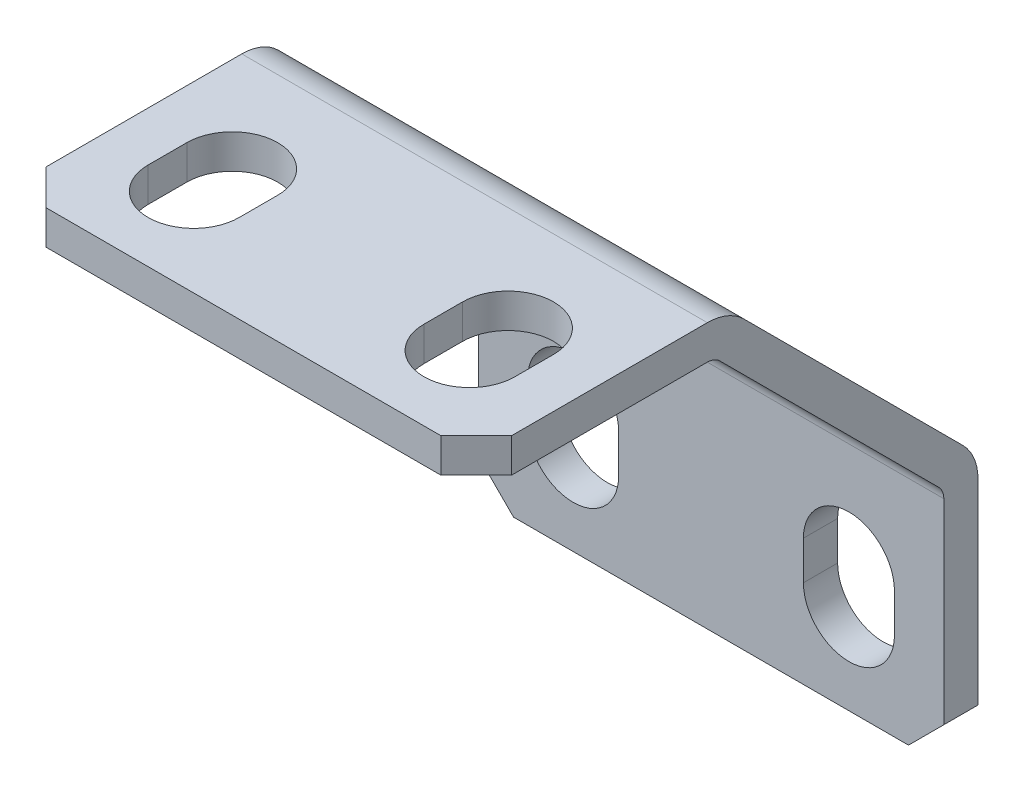
ISO-10303-21;
HEADER;
FILE_DESCRIPTION(('STEP AP214'),'2;1');
FILE_NAME('part.step','',(''),(''),'','','');
FILE_SCHEMA(('AUTOMOTIVE_DESIGN { 1 0 10303 214 1 1 1 1 }'));
ENDSEC;
DATA;
#1=APPLICATION_CONTEXT('core data for automotive mechanical design processes');
#2=APPLICATION_PROTOCOL_DEFINITION('international standard','automotive_design',2000,#1);
#3=PRODUCT_CONTEXT('',#1,'mechanical');
#4=PRODUCT('Part','Part','',(#3));
#5=PRODUCT_RELATED_PRODUCT_CATEGORY('part','',(#4));
#6=PRODUCT_DEFINITION_FORMATION('','',#4);
#7=PRODUCT_DEFINITION_CONTEXT('part definition',#1,'design');
#8=PRODUCT_DEFINITION('design','',#6,#7);
#9=PRODUCT_DEFINITION_SHAPE('','',#8);
#10=(LENGTH_UNIT() NAMED_UNIT(*) SI_UNIT(.MILLI.,.METRE.));
#11=(NAMED_UNIT(*) PLANE_ANGLE_UNIT() SI_UNIT($,.RADIAN.));
#12=(NAMED_UNIT(*) SI_UNIT($,.STERADIAN.) SOLID_ANGLE_UNIT());
#13=UNCERTAINTY_MEASURE_WITH_UNIT(LENGTH_MEASURE(1.E-05),#10,'distance_accuracy_value','');
#14=(GEOMETRIC_REPRESENTATION_CONTEXT(3) GLOBAL_UNCERTAINTY_ASSIGNED_CONTEXT((#13)) GLOBAL_UNIT_ASSIGNED_CONTEXT((#10,
#11,#12)) REPRESENTATION_CONTEXT('',''));
#15=CARTESIAN_POINT('',(0.,0.,0.));
#16=DIRECTION('',(0.,0.,1.));
#17=DIRECTION('',(1.,0.,0.));
#18=AXIS2_PLACEMENT_3D('',#15,#16,#17);
#19=CARTESIAN_POINT('',(-10.7188,17.785895496044,11.4756191945219));
#20=DIRECTION('',(0.,1.,0.));
#21=DIRECTION('',(0.,0.,1.));
#22=AXIS2_PLACEMENT_3D('',#19,#20,#21);
#23=PLANE('',#22);
#24=CARTESIAN_POINT('',(6.34999999999999,17.7858954960441,19.0499999999998));
#25=DIRECTION('',(0.,1.,0.));
#26=DIRECTION('',(0.,0.,1.));
#27=AXIS2_PLACEMENT_3D('',#24,#25,#26);
#28=CIRCLE('',#27,2.0955);
#29=CARTESIAN_POINT('',(4.2545,17.7858954960441,19.0499999999998));
#30=VERTEX_POINT('',#29);
#31=CARTESIAN_POINT('',(8.4455,17.7858954960441,19.0500000000001));
#32=VERTEX_POINT('',#31);
#33=EDGE_CURVE('E302',#30,#32,#28,.T.);
#34=ORIENTED_EDGE('',*,*,#33,.F.);
#35=DIRECTION('',(0.,0.,1.));
#36=VECTOR('',#35,1.);
#37=CARTESIAN_POINT('',(4.2545,17.7858954960441,17.2719999999998));
#38=LINE('',#37,#36);
#39=CARTESIAN_POINT('',(4.2545,17.7858954960441,17.2719999999998));
#40=VERTEX_POINT('',#39);
#41=EDGE_CURVE('E316',#40,#30,#38,.T.);
#42=ORIENTED_EDGE('',*,*,#41,.F.);
#43=CARTESIAN_POINT('',(6.35,17.7858954960441,17.2719999999998));
#44=DIRECTION('',(0.,1.,0.));
#45=DIRECTION('',(0.,0.,1.));
#46=AXIS2_PLACEMENT_3D('',#43,#44,#45);
#47=CIRCLE('',#46,2.0955);
#48=CARTESIAN_POINT('',(8.4455,17.7858954960441,17.2719999999998));
#49=VERTEX_POINT('',#48);
#50=EDGE_CURVE('E313',#49,#40,#47,.T.);
#51=ORIENTED_EDGE('',*,*,#50,.F.);
#52=DIRECTION('',(0.,0.,-1.));
#53=VECTOR('',#52,1.);
#54=CARTESIAN_POINT('',(8.4455,17.7858954960441,19.0499999999998));
#55=LINE('',#54,#53);
#56=EDGE_CURVE('E310',#32,#49,#55,.T.);
#57=ORIENTED_EDGE('',*,*,#56,.F.);
#58=EDGE_LOOP('',(#34,#42,#51,#57));
#59=FACE_BOUND('',#58,.T.);
#60=CARTESIAN_POINT('',(-6.35,17.7858954960442,17.2719999999998));
#61=DIRECTION('',(0.,-1.,0.));
#62=DIRECTION('',(0.,0.,-1.));
#63=AXIS2_PLACEMENT_3D('',#60,#61,#62);
#64=CIRCLE('',#63,2.0955);
#65=CARTESIAN_POINT('',(-8.4455,17.7858954960442,17.2719999999998));
#66=VERTEX_POINT('',#65);
#67=CARTESIAN_POINT('',(-4.2545,17.7858954960442,17.2719999999998));
#68=VERTEX_POINT('',#67);
#69=EDGE_CURVE('E329',#66,#68,#64,.T.);
#70=ORIENTED_EDGE('',*,*,#69,.T.);
#71=DIRECTION('',(0.,0.,1.));
#72=VECTOR('',#71,1.);
#73=CARTESIAN_POINT('',(-4.2545,17.7858954960442,17.2719999999998));
#74=LINE('',#73,#72);
#75=CARTESIAN_POINT('',(-4.2545,17.7858954960441,19.0499999999998));
#76=VERTEX_POINT('',#75);
#77=EDGE_CURVE('E332',#68,#76,#74,.T.);
#78=ORIENTED_EDGE('',*,*,#77,.T.);
#79=CARTESIAN_POINT('',(-6.35,17.7858954960442,19.0499999999998));
#80=DIRECTION('',(0.,-1.,0.));
#81=DIRECTION('',(0.,0.,-1.));
#82=AXIS2_PLACEMENT_3D('',#79,#80,#81);
#83=CIRCLE('',#82,2.0955);
#84=CARTESIAN_POINT('',(-8.4455,17.7858954960442,19.0499999999998));
#85=VERTEX_POINT('',#84);
#86=EDGE_CURVE('E336',#76,#85,#83,.T.);
#87=ORIENTED_EDGE('',*,*,#86,.T.);
#88=DIRECTION('',(0.,0.,-1.));
#89=VECTOR('',#88,1.);
#90=CARTESIAN_POINT('',(-8.4455,17.7858954960442,19.0499999999998));
#91=LINE('',#90,#89);
#92=EDGE_CURVE('E339',#85,#66,#91,.T.);
#93=ORIENTED_EDGE('',*,*,#92,.T.);
#94=EDGE_LOOP('',(#70,#78,#87,#93));
#95=FACE_BOUND('',#94,.T.);
#96=DIRECTION('',(0.,0.,1.));
#97=VECTOR('',#96,1.);
#98=CARTESIAN_POINT('',(10.7188,17.785895496044,11.4756191945219));
#99=LINE('',#98,#97);
#100=CARTESIAN_POINT('',(10.7188,17.785895496044,12.4645954960439));
#101=VERTEX_POINT('',#100);
#102=CARTESIAN_POINT('',(10.7188,17.7858954960441,21.4806791945219));
#103=VERTEX_POINT('',#102);
#104=EDGE_CURVE('E380',#101,#103,#99,.T.);
#105=ORIENTED_EDGE('',*,*,#104,.F.);
#106=DIRECTION('',(1.,0.,0.));
#107=VECTOR('',#106,1.);
#108=CARTESIAN_POINT('',(-10.7188,17.785895496044,12.4645954960439));
#109=LINE('',#108,#107);
#110=CARTESIAN_POINT('',(-10.7188,17.785895496044,12.4645954960439));
#111=VERTEX_POINT('',#110);
#112=EDGE_CURVE('E11',#101,#111,#109,.F.);
#113=ORIENTED_EDGE('',*,*,#112,.T.);
#114=DIRECTION('',(0.,0.,1.));
#115=VECTOR('',#114,1.);
#116=CARTESIAN_POINT('',(-10.7188,17.785895496044,11.4756191945219));
#117=LINE('',#116,#115);
#118=CARTESIAN_POINT('',(-10.7188,17.7858954960441,21.4806791945219));
#119=VERTEX_POINT('',#118);
#120=EDGE_CURVE('E383',#111,#119,#117,.T.);
#121=ORIENTED_EDGE('',*,*,#120,.T.);
#122=DIRECTION('',(0.707106781186545,0.,0.70710678118655));
#123=VECTOR('',#122,1.);
#124=CARTESIAN_POINT('',(-15.72133,17.7858954960441,16.4781491945219));
#125=LINE('',#124,#123);
#126=CARTESIAN_POINT('',(-9.09320000000001,17.7858954960442,23.1062791945219));
#127=VERTEX_POINT('',#126);
#128=EDGE_CURVE('E439',#119,#127,#125,.T.);
#129=ORIENTED_EDGE('',*,*,#128,.T.);
#130=DIRECTION('',(1.,0.,0.));
#131=VECTOR('',#130,1.);
#132=CARTESIAN_POINT('',(-10.7188,17.7858954960442,23.1062791945219));
#133=LINE('',#132,#131);
#134=CARTESIAN_POINT('',(9.09319999999999,17.7858954960442,23.1062791945219));
#135=VERTEX_POINT('',#134);
#136=EDGE_CURVE('E391',#127,#135,#133,.T.);
#137=ORIENTED_EDGE('',*,*,#136,.T.);
#138=DIRECTION('',(-0.707106781186552,0.,0.707106781186543));
#139=VECTOR('',#138,1.);
#140=CARTESIAN_POINT('',(5.00252999999986,17.7858954960442,27.196949194522));
#141=LINE('',#140,#139);
#142=EDGE_CURVE('E441',#135,#103,#141,.F.);
#143=ORIENTED_EDGE('',*,*,#142,.T.);
#144=EDGE_LOOP('',(#105,#113,#121,#129,#137,#143));
#145=FACE_BOUND('',#144,.T.);
#146=ADVANCED_FACE('F32',(#59,#95,#145),#23,.T.);
#147=CARTESIAN_POINT('',(-10.7188,6.31027630152199,0.));
#148=DIRECTION('',(0.,0.707106781186544,-0.707106781186551));
#149=DIRECTION('',(0.,0.707106781186551,0.707106781186544));
#150=AXIS2_PLACEMENT_3D('',#147,#148,#149);
#151=PLANE('',#150);
#152=DIRECTION('',(0.,0.707106781186551,0.707106781186544));
#153=VECTOR('',#152,1.);
#154=CARTESIAN_POINT('',(10.7188,6.31027630152199,0.));
#155=LINE('',#154,#153);
#156=CARTESIAN_POINT('',(10.7188,7.00958815076099,0.699311849238991));
#157=VERTEX_POINT('',#156);
#158=CARTESIAN_POINT('',(10.7188,17.086583646805,10.7763073452829));
#159=VERTEX_POINT('',#158);
#160=EDGE_CURVE('E386',#157,#159,#155,.T.);
#161=ORIENTED_EDGE('',*,*,#160,.F.);
#162=DIRECTION('',(1.,0.,0.));
#163=VECTOR('',#162,1.);
#164=CARTESIAN_POINT('',(-10.7188,7.00958815076099,0.699311849238991));
#165=LINE('',#164,#163);
#166=CARTESIAN_POINT('',(-10.7188,7.00958815076099,0.699311849238991));
#167=VERTEX_POINT('',#166);
#168=EDGE_CURVE('E492',#157,#167,#165,.F.);
#169=ORIENTED_EDGE('',*,*,#168,.T.);
#170=DIRECTION('',(0.,0.707106781186551,0.707106781186544));
#171=VECTOR('',#170,1.);
#172=CARTESIAN_POINT('',(-10.7188,6.31027630152199,0.));
#173=LINE('',#172,#171);
#174=CARTESIAN_POINT('',(-10.7188,17.086583646805,10.7763073452829));
#175=VERTEX_POINT('',#174);
#176=EDGE_CURVE('E389',#167,#175,#173,.T.);
#177=ORIENTED_EDGE('',*,*,#176,.T.);
#178=DIRECTION('',(1.,0.,0.));
#179=VECTOR('',#178,1.);
#180=CARTESIAN_POINT('',(-10.7188,17.086583646805,10.7763073452829));
#181=LINE('',#180,#179);
#182=EDGE_CURVE('E489',#175,#159,#181,.T.);
#183=ORIENTED_EDGE('',*,*,#182,.T.);
#184=EDGE_LOOP('',(#161,#169,#177,#183));
#185=FACE_BOUND('',#184,.T.);
#186=ADVANCED_FACE('F509',(#185),#151,.T.);
#187=CARTESIAN_POINT('',(-10.7188,-5.3213,0.));
#188=DIRECTION('',(0.,0.,-1.));
#189=DIRECTION('',(-1.,0.,0.));
#190=AXIS2_PLACEMENT_3D('',#187,#188,#189);
#191=PLANE('',#190);
#192=CARTESIAN_POINT('',(-6.35,-1.26410450395596,0.));
#193=DIRECTION('',(0.,0.,-1.));
#194=DIRECTION('',(-1.,0.,0.));
#195=AXIS2_PLACEMENT_3D('',#192,#193,#194);
#196=CIRCLE('',#195,2.0955);
#197=CARTESIAN_POINT('',(-4.2545,-1.26410450395596,0.));
#198=VERTEX_POINT('',#197);
#199=CARTESIAN_POINT('',(-8.4455,-1.26410450395596,0.));
#200=VERTEX_POINT('',#199);
#201=EDGE_CURVE('E262',#198,#200,#196,.T.);
#202=ORIENTED_EDGE('',*,*,#201,.F.);
#203=DIRECTION('',(0.,-1.,0.));
#204=VECTOR('',#203,1.);
#205=CARTESIAN_POINT('',(-4.2545,0.513895496044045,0.));
#206=LINE('',#205,#204);
#207=CARTESIAN_POINT('',(-4.2545,0.513895496044045,0.));
#208=VERTEX_POINT('',#207);
#209=EDGE_CURVE('E267',#208,#198,#206,.T.);
#210=ORIENTED_EDGE('',*,*,#209,.F.);
#211=CARTESIAN_POINT('',(-6.35,0.513895496044045,0.));
#212=DIRECTION('',(0.,0.,-1.));
#213=DIRECTION('',(-1.,0.,0.));
#214=AXIS2_PLACEMENT_3D('',#211,#212,#213);
#215=CIRCLE('',#214,2.0955);
#216=CARTESIAN_POINT('',(-8.4455,0.513895496044045,0.));
#217=VERTEX_POINT('',#216);
#218=EDGE_CURVE('E246',#217,#208,#215,.T.);
#219=ORIENTED_EDGE('',*,*,#218,.F.);
#220=DIRECTION('',(0.,1.,0.));
#221=VECTOR('',#220,1.);
#222=CARTESIAN_POINT('',(-8.4455,-1.26410450395596,0.));
#223=LINE('',#222,#221);
#224=EDGE_CURVE('E257',#200,#217,#223,.T.);
#225=ORIENTED_EDGE('',*,*,#224,.F.);
#226=EDGE_LOOP('',(#202,#210,#219,#225));
#227=FACE_BOUND('',#226,.T.);
#228=CARTESIAN_POINT('',(6.35,0.513895496044045,0.));
#229=DIRECTION('',(0.,0.,1.));
#230=DIRECTION('',(1.,0.,0.));
#231=AXIS2_PLACEMENT_3D('',#228,#229,#230);
#232=CIRCLE('',#231,2.0955);
#233=CARTESIAN_POINT('',(8.4455,0.513895496044045,0.));
#234=VERTEX_POINT('',#233);
#235=CARTESIAN_POINT('',(4.2545,0.513895496044045,0.));
#236=VERTEX_POINT('',#235);
#237=EDGE_CURVE('E277',#234,#236,#232,.T.);
#238=ORIENTED_EDGE('',*,*,#237,.T.);
#239=DIRECTION('',(0.,-1.,0.));
#240=VECTOR('',#239,1.);
#241=CARTESIAN_POINT('',(4.2545,0.513895496044045,0.));
#242=LINE('',#241,#240);
#243=CARTESIAN_POINT('',(4.2545,-1.26410450395596,0.));
#244=VERTEX_POINT('',#243);
#245=EDGE_CURVE('E280',#236,#244,#242,.T.);
#246=ORIENTED_EDGE('',*,*,#245,.T.);
#247=CARTESIAN_POINT('',(6.35,-1.26410450395596,0.));
#248=DIRECTION('',(0.,0.,1.));
#249=DIRECTION('',(1.,0.,0.));
#250=AXIS2_PLACEMENT_3D('',#247,#248,#249);
#251=CIRCLE('',#250,2.0955);
#252=CARTESIAN_POINT('',(8.4455,-1.26410450395596,0.));
#253=VERTEX_POINT('',#252);
#254=EDGE_CURVE('E284',#244,#253,#251,.T.);
#255=ORIENTED_EDGE('',*,*,#254,.T.);
#256=DIRECTION('',(0.,1.,0.));
#257=VECTOR('',#256,1.);
#258=CARTESIAN_POINT('',(8.4455,-1.26410450395596,0.));
#259=LINE('',#258,#257);
#260=EDGE_CURVE('E287',#253,#234,#259,.T.);
#261=ORIENTED_EDGE('',*,*,#260,.T.);
#262=EDGE_LOOP('',(#238,#246,#255,#261));
#263=FACE_BOUND('',#262,.T.);
#264=DIRECTION('',(0.,1.,0.));
#265=VECTOR('',#264,1.);
#266=CARTESIAN_POINT('',(-10.7188,-5.3213,0.));
#267=LINE('',#266,#265);
#268=CARTESIAN_POINT('',(-10.7188,-3.69569999999999,0.));
#269=VERTEX_POINT('',#268);
#270=CARTESIAN_POINT('',(-10.7188,5.3213,0.));
#271=VERTEX_POINT('',#270);
#272=EDGE_CURVE('E385',#269,#271,#267,.T.);
#273=ORIENTED_EDGE('',*,*,#272,.T.);
#274=DIRECTION('',(1.,0.,0.));
#275=VECTOR('',#274,1.);
#276=CARTESIAN_POINT('',(-10.7188,5.3213,0.));
#277=LINE('',#276,#275);
#278=CARTESIAN_POINT('',(10.7188,5.3213,0.));
#279=VERTEX_POINT('',#278);
#280=EDGE_CURVE('E482',#271,#279,#277,.T.);
#281=ORIENTED_EDGE('',*,*,#280,.T.);
#282=DIRECTION('',(0.,1.,0.));
#283=VECTOR('',#282,1.);
#284=CARTESIAN_POINT('',(10.7188,-5.3213,0.));
#285=LINE('',#284,#283);
#286=CARTESIAN_POINT('',(10.7188,-3.6957,0.));
#287=VERTEX_POINT('',#286);
#288=EDGE_CURVE('E393',#287,#279,#285,.T.);
#289=ORIENTED_EDGE('',*,*,#288,.F.);
#290=DIRECTION('',(0.707106781186551,0.707106781186544,0.));
#291=VECTOR('',#290,1.);
#292=CARTESIAN_POINT('',(-0.812800000000091,-15.2273,0.));
#293=LINE('',#292,#291);
#294=CARTESIAN_POINT('',(9.09319999999999,-5.3213,0.));
#295=VERTEX_POINT('',#294);
#296=EDGE_CURVE('E446',#287,#295,#293,.F.);
#297=ORIENTED_EDGE('',*,*,#296,.T.);
#298=DIRECTION('',(1.,0.,0.));
#299=VECTOR('',#298,1.);
#300=CARTESIAN_POINT('',(-10.7188,-5.3213,0.));
#301=LINE('',#300,#299);
#302=CARTESIAN_POINT('',(-9.0932,-5.3213,0.));
#303=VERTEX_POINT('',#302);
#304=EDGE_CURVE('E398',#303,#295,#301,.T.);
#305=ORIENTED_EDGE('',*,*,#304,.F.);
#306=DIRECTION('',(-0.707106781186544,0.707106781186551,0.));
#307=VECTOR('',#306,1.);
#308=CARTESIAN_POINT('',(-9.906,-4.5085,0.));
#309=LINE('',#308,#307);
#310=EDGE_CURVE('E444',#303,#269,#309,.T.);
#311=ORIENTED_EDGE('',*,*,#310,.T.);
#312=EDGE_LOOP('',(#273,#281,#289,#297,#305,#311));
#313=FACE_BOUND('',#312,.T.);
#314=ADVANCED_FACE('F264',(#227,#263,#313),#191,.T.);
#315=CARTESIAN_POINT('',(-10.7188,-5.3213,23.1062791945222));
#316=DIRECTION('',(0.,-1.,0.));
#317=DIRECTION('',(0.,0.,-1.));
#318=AXIS2_PLACEMENT_3D('',#315,#316,#317);
#319=PLANE('',#318);
#320=ORIENTED_EDGE('',*,*,#304,.T.);
#321=DIRECTION('',(0.,0.,1.));
#322=VECTOR('',#321,1.);
#323=CARTESIAN_POINT('',(9.09319999999999,-5.3213,23.1062791945222));
#324=LINE('',#323,#322);
#325=CARTESIAN_POINT('',(9.09319999999999,-5.3213,1.5748));
#326=VERTEX_POINT('',#325);
#327=EDGE_CURVE('E451',#295,#326,#324,.T.);
#328=ORIENTED_EDGE('',*,*,#327,.T.);
#329=DIRECTION('',(-1.,0.,0.));
#330=VECTOR('',#329,1.);
#331=CARTESIAN_POINT('',(10.7188,-5.3213,1.5748));
#332=LINE('',#331,#330);
#333=CARTESIAN_POINT('',(-9.09320000000001,-5.3213,1.5748));
#334=VERTEX_POINT('',#333);
#335=EDGE_CURVE('E377',#326,#334,#332,.T.);
#336=ORIENTED_EDGE('',*,*,#335,.T.);
#337=DIRECTION('',(0.,0.,-1.));
#338=VECTOR('',#337,1.);
#339=CARTESIAN_POINT('',(-9.0932,-5.3213,0.));
#340=LINE('',#339,#338);
#341=EDGE_CURVE('E448',#334,#303,#340,.T.);
#342=ORIENTED_EDGE('',*,*,#341,.T.);
#343=EDGE_LOOP('',(#320,#328,#336,#342));
#344=FACE_BOUND('',#343,.T.);
#345=ADVANCED_FACE('F548',(#344),#319,.T.);
#346=CARTESIAN_POINT('',(-10.7188,17.7858954960442,23.1062791945219));
#347=DIRECTION('',(0.,0.,1.));
#348=DIRECTION('',(0.,-1.,0.));
#349=AXIS2_PLACEMENT_3D('',#346,#347,#348);
#350=PLANE('',#349);
#351=DIRECTION('',(-1.,0.,0.));
#352=VECTOR('',#351,1.);
#353=CARTESIAN_POINT('',(10.7188,16.211095496044,23.1062791945222));
#354=LINE('',#353,#352);
#355=CARTESIAN_POINT('',(9.09319999999999,16.211095496044,23.1062791945222));
#356=VERTEX_POINT('',#355);
#357=CARTESIAN_POINT('',(-9.09319999999978,16.211095496044,23.1062791945222));
#358=VERTEX_POINT('',#357);
#359=EDGE_CURVE('E370',#356,#358,#354,.T.);
#360=ORIENTED_EDGE('',*,*,#359,.F.);
#361=DIRECTION('',(0.,1.,0.));
#362=VECTOR('',#361,1.);
#363=CARTESIAN_POINT('',(9.09319999999999,17.7858954960442,23.1062791945219));
#364=LINE('',#363,#362);
#365=EDGE_CURVE('E437',#356,#135,#364,.T.);
#366=ORIENTED_EDGE('',*,*,#365,.T.);
#367=ORIENTED_EDGE('',*,*,#136,.F.);
#368=DIRECTION('',(0.,-1.,0.));
#369=VECTOR('',#368,1.);
#370=CARTESIAN_POINT('',(-9.0932,16.211095496044,23.1062791945219));
#371=LINE('',#370,#369);
#372=EDGE_CURVE('E434',#127,#358,#371,.T.);
#373=ORIENTED_EDGE('',*,*,#372,.T.);
#374=EDGE_LOOP('',(#360,#366,#367,#373));
#375=FACE_BOUND('',#374,.T.);
#376=ADVANCED_FACE('F559',(#375),#350,.T.);
#377=CARTESIAN_POINT('',(-10.7188,0.,0.));
#378=DIRECTION('',(1.,0.,0.));
#379=DIRECTION('',(0.,0.,-1.));
#380=AXIS2_PLACEMENT_3D('',#377,#378,#379);
#381=PLANE('',#380);
#382=ORIENTED_EDGE('',*,*,#176,.F.);
#383=CARTESIAN_POINT('',(-10.7188,5.3213,2.3876));
#384=DIRECTION('',(1.,0.,0.));
#385=DIRECTION('',(0.,0.,-1.));
#386=AXIS2_PLACEMENT_3D('',#383,#384,#385);
#387=CIRCLE('',#386,2.3876);
#388=EDGE_CURVE('E40',#167,#271,#387,.F.);
#389=ORIENTED_EDGE('',*,*,#388,.T.);
#390=ORIENTED_EDGE('',*,*,#272,.F.);
#391=DIRECTION('',(0.,0.,1.));
#392=VECTOR('',#391,1.);
#393=CARTESIAN_POINT('',(-10.7188,-3.69569999999999,1.5748));
#394=LINE('',#393,#392);
#395=CARTESIAN_POINT('',(-10.7188,-3.69569999999999,1.5748));
#396=VERTEX_POINT('',#395);
#397=EDGE_CURVE('E458',#269,#396,#394,.T.);
#398=ORIENTED_EDGE('',*,*,#397,.T.);
#399=DIRECTION('',(0.,-1.,0.));
#400=VECTOR('',#399,1.);
#401=CARTESIAN_POINT('',(-10.7188,5.65797278349685,1.5748));
#402=LINE('',#401,#400);
#403=CARTESIAN_POINT('',(-10.7188,5.3213,1.5748));
#404=VERTEX_POINT('',#403);
#405=EDGE_CURVE('E365',#404,#396,#402,.T.);
#406=ORIENTED_EDGE('',*,*,#405,.F.);
#407=CARTESIAN_POINT('',(-10.7188,5.3213,2.3876));
#408=DIRECTION('',(1.,0.,0.));
#409=DIRECTION('',(0.,0.,-1.));
#410=AXIS2_PLACEMENT_3D('',#407,#408,#409);
#411=CIRCLE('',#410,0.812800000000003);
#412=CARTESIAN_POINT('',(-10.7188,5.89603639174842,1.81286360825157));
#413=VERTEX_POINT('',#412);
#414=EDGE_CURVE('E478',#404,#413,#411,.T.);
#415=ORIENTED_EDGE('',*,*,#414,.T.);
#416=DIRECTION('',(0.,-0.707106781186551,-0.707106781186544));
#417=VECTOR('',#416,1.);
#418=CARTESIAN_POINT('',(-10.7188,16.211095496044,12.1279227125471));
#419=LINE('',#418,#417);
#420=CARTESIAN_POINT('',(-10.7188,15.9730318877925,11.8898591042955));
#421=VERTEX_POINT('',#420);
#422=EDGE_CURVE('E373',#421,#413,#419,.T.);
#423=ORIENTED_EDGE('',*,*,#422,.F.);
#424=CARTESIAN_POINT('',(-10.7188,15.398295496044,12.4645954960439));
#425=DIRECTION('',(1.,0.,0.));
#426=DIRECTION('',(0.,0.,-1.));
#427=AXIS2_PLACEMENT_3D('',#424,#425,#426);
#428=CIRCLE('',#427,0.812800000000003);
#429=CARTESIAN_POINT('',(-10.7188,16.211095496044,12.4645954960439));
#430=VERTEX_POINT('',#429);
#431=EDGE_CURVE('E474',#421,#430,#428,.T.);
#432=ORIENTED_EDGE('',*,*,#431,.T.);
#433=DIRECTION('',(0.,0.,-1.));
#434=VECTOR('',#433,1.);
#435=CARTESIAN_POINT('',(-10.7188,16.211095496044,23.1062791945222));
#436=LINE('',#435,#434);
#437=CARTESIAN_POINT('',(-10.7188,16.211095496044,21.4806791945219));
#438=VERTEX_POINT('',#437);
#439=EDGE_CURVE('E354',#438,#430,#436,.T.);
#440=ORIENTED_EDGE('',*,*,#439,.F.);
#441=DIRECTION('',(0.,1.,0.));
#442=VECTOR('',#441,1.);
#443=CARTESIAN_POINT('',(-10.7188,17.7858954960441,21.4806791945219));
#444=LINE('',#443,#442);
#445=EDGE_CURVE('E461',#438,#119,#444,.T.);
#446=ORIENTED_EDGE('',*,*,#445,.T.);
#447=ORIENTED_EDGE('',*,*,#120,.F.);
#448=CARTESIAN_POINT('',(-10.7188,15.398295496044,12.4645954960439));
#449=DIRECTION('',(1.,0.,0.));
#450=DIRECTION('',(0.,0.,-1.));
#451=AXIS2_PLACEMENT_3D('',#448,#449,#450);
#452=CIRCLE('',#451,2.3876);
#453=EDGE_CURVE('E52',#111,#175,#452,.F.);
#454=ORIENTED_EDGE('',*,*,#453,.T.);
#455=EDGE_LOOP('',(#382,#389,#390,#398,#406,#415,#423,#432,#440,#446,#447,#454));
#456=FACE_BOUND('',#455,.T.);
#457=ADVANCED_FACE('F496',(#456),#381,.F.);
#458=CARTESIAN_POINT('',(10.7188,0.,0.));
#459=DIRECTION('',(1.,0.,0.));
#460=DIRECTION('',(0.,0.,-1.));
#461=AXIS2_PLACEMENT_3D('',#458,#459,#460);
#462=PLANE('',#461);
#463=ORIENTED_EDGE('',*,*,#288,.T.);
#464=CARTESIAN_POINT('',(10.7188,5.3213,2.3876));
#465=DIRECTION('',(1.,0.,0.));
#466=DIRECTION('',(0.,0.,-1.));
#467=AXIS2_PLACEMENT_3D('',#464,#465,#466);
#468=CIRCLE('',#467,2.3876);
#469=EDGE_CURVE('E487',#279,#157,#468,.T.);
#470=ORIENTED_EDGE('',*,*,#469,.T.);
#471=ORIENTED_EDGE('',*,*,#160,.T.);
#472=CARTESIAN_POINT('',(10.7188,15.398295496044,12.4645954960439));
#473=DIRECTION('',(1.,0.,0.));
#474=DIRECTION('',(0.,0.,-1.));
#475=AXIS2_PLACEMENT_3D('',#472,#473,#474);
#476=CIRCLE('',#475,2.3876);
#477=EDGE_CURVE('E485',#159,#101,#476,.T.);
#478=ORIENTED_EDGE('',*,*,#477,.T.);
#479=ORIENTED_EDGE('',*,*,#104,.T.);
#480=DIRECTION('',(0.,-1.,0.));
#481=VECTOR('',#480,1.);
#482=CARTESIAN_POINT('',(10.7188,2.2576627215129E-13,21.4806791945221));
#483=LINE('',#482,#481);
#484=CARTESIAN_POINT('',(10.7188,16.211095496044,21.4806791945219));
#485=VERTEX_POINT('',#484);
#486=EDGE_CURVE('E427',#103,#485,#483,.T.);
#487=ORIENTED_EDGE('',*,*,#486,.T.);
#488=DIRECTION('',(0.,0.,-1.));
#489=VECTOR('',#488,1.);
#490=CARTESIAN_POINT('',(10.7188,16.211095496044,23.1062791945222));
#491=LINE('',#490,#489);
#492=CARTESIAN_POINT('',(10.7188,16.211095496044,12.4645954960439));
#493=VERTEX_POINT('',#492);
#494=EDGE_CURVE('E361',#485,#493,#491,.T.);
#495=ORIENTED_EDGE('',*,*,#494,.T.);
#496=CARTESIAN_POINT('',(10.7188,15.398295496044,12.4645954960439));
#497=DIRECTION('',(1.,0.,0.));
#498=DIRECTION('',(0.,0.,-1.));
#499=AXIS2_PLACEMENT_3D('',#496,#497,#498);
#500=CIRCLE('',#499,0.812800000000003);
#501=CARTESIAN_POINT('',(10.7188,15.9730318877925,11.8898591042955));
#502=VERTEX_POINT('',#501);
#503=EDGE_CURVE('E476',#493,#502,#500,.F.);
#504=ORIENTED_EDGE('',*,*,#503,.T.);
#505=DIRECTION('',(0.,-0.707106781186551,-0.707106781186544));
#506=VECTOR('',#505,1.);
#507=CARTESIAN_POINT('',(10.7188,16.211095496044,12.1279227125471));
#508=LINE('',#507,#506);
#509=CARTESIAN_POINT('',(10.7188,5.89603639174843,1.81286360825157));
#510=VERTEX_POINT('',#509);
#511=EDGE_CURVE('E364',#502,#510,#508,.T.);
#512=ORIENTED_EDGE('',*,*,#511,.T.);
#513=CARTESIAN_POINT('',(10.7188,5.3213,2.3876));
#514=DIRECTION('',(1.,0.,0.));
#515=DIRECTION('',(0.,0.,-1.));
#516=AXIS2_PLACEMENT_3D('',#513,#514,#515);
#517=CIRCLE('',#516,0.812800000000003);
#518=CARTESIAN_POINT('',(10.7188,5.3213,1.5748));
#519=VERTEX_POINT('',#518);
#520=EDGE_CURVE('E480',#510,#519,#517,.F.);
#521=ORIENTED_EDGE('',*,*,#520,.T.);
#522=DIRECTION('',(0.,-1.,0.));
#523=VECTOR('',#522,1.);
#524=CARTESIAN_POINT('',(10.7188,5.65797278349685,1.5748));
#525=LINE('',#524,#523);
#526=CARTESIAN_POINT('',(10.7188,-3.69570000000001,1.5748));
#527=VERTEX_POINT('',#526);
#528=EDGE_CURVE('E368',#519,#527,#525,.T.);
#529=ORIENTED_EDGE('',*,*,#528,.T.);
#530=DIRECTION('',(0.,0.,-1.));
#531=VECTOR('',#530,1.);
#532=CARTESIAN_POINT('',(10.7188,-3.6957,0.));
#533=LINE('',#532,#531);
#534=EDGE_CURVE('E424',#527,#287,#533,.T.);
#535=ORIENTED_EDGE('',*,*,#534,.T.);
#536=EDGE_LOOP('',(#463,#470,#471,#478,#479,#487,#495,#504,#512,#521,#529,#535));
#537=FACE_BOUND('',#536,.T.);
#538=ADVANCED_FACE('F507',(#537),#462,.T.);
#539=CARTESIAN_POINT('',(10.7188,5.65797278349685,1.5748));
#540=DIRECTION('',(0.,0.,-1.));
#541=DIRECTION('',(0.,1.,0.));
#542=AXIS2_PLACEMENT_3D('',#539,#540,#541);
#543=PLANE('',#542);
#544=DIRECTION('',(0.,-1.,0.));
#545=VECTOR('',#544,1.);
#546=CARTESIAN_POINT('',(-4.2545,5.65797278349685,1.5748));
#547=LINE('',#546,#545);
#548=CARTESIAN_POINT('',(-4.2545,0.513895496044045,1.5748));
#549=VERTEX_POINT('',#548);
#550=CARTESIAN_POINT('',(-4.2545,-1.26410450395596,1.5748));
#551=VERTEX_POINT('',#550);
#552=EDGE_CURVE('E418',#549,#551,#547,.T.);
#553=ORIENTED_EDGE('',*,*,#552,.T.);
#554=CARTESIAN_POINT('',(-6.35,-1.26410450395596,1.5748));
#555=DIRECTION('',(0.,0.,-1.));
#556=DIRECTION('',(0.,1.,0.));
#557=AXIS2_PLACEMENT_3D('',#554,#555,#556);
#558=CIRCLE('',#557,2.0955);
#559=CARTESIAN_POINT('',(-8.4455,-1.26410450395596,1.5748));
#560=VERTEX_POINT('',#559);
#561=EDGE_CURVE('E421',#551,#560,#558,.T.);
#562=ORIENTED_EDGE('',*,*,#561,.T.);
#563=DIRECTION('',(0.,1.,0.));
#564=VECTOR('',#563,1.);
#565=CARTESIAN_POINT('',(-8.4455,5.65797278349685,1.5748));
#566=LINE('',#565,#564);
#567=CARTESIAN_POINT('',(-8.4455,0.513895496044045,1.5748));
#568=VERTEX_POINT('',#567);
#569=EDGE_CURVE('E415',#560,#568,#566,.T.);
#570=ORIENTED_EDGE('',*,*,#569,.T.);
#571=CARTESIAN_POINT('',(-6.35,0.513895496044045,1.5748));
#572=DIRECTION('',(0.,0.,-1.));
#573=DIRECTION('',(0.,1.,0.));
#574=AXIS2_PLACEMENT_3D('',#571,#572,#573);
#575=CIRCLE('',#574,2.0955);
#576=EDGE_CURVE('E249',#568,#549,#575,.T.);
#577=ORIENTED_EDGE('',*,*,#576,.T.);
#578=EDGE_LOOP('',(#553,#562,#570,#577));
#579=FACE_BOUND('',#578,.T.);
#580=DIRECTION('',(0.,-1.,0.));
#581=VECTOR('',#580,1.);
#582=CARTESIAN_POINT('',(4.2545,0.513895496044045,1.5748));
#583=LINE('',#582,#581);
#584=CARTESIAN_POINT('',(4.2545,0.513895496044046,1.5748));
#585=VERTEX_POINT('',#584);
#586=CARTESIAN_POINT('',(4.2545,-1.26410450395596,1.5748));
#587=VERTEX_POINT('',#586);
#588=EDGE_CURVE('E292',#585,#587,#583,.T.);
#589=ORIENTED_EDGE('',*,*,#588,.F.);
#590=CARTESIAN_POINT('',(6.35,0.513895496044045,1.5748));
#591=DIRECTION('',(0.,0.,1.));
#592=DIRECTION('',(1.,0.,0.));
#593=AXIS2_PLACEMENT_3D('',#590,#591,#592);
#594=CIRCLE('',#593,2.0955);
#595=CARTESIAN_POINT('',(8.4455,0.513895496044045,1.5748));
#596=VERTEX_POINT('',#595);
#597=EDGE_CURVE('E274',#596,#585,#594,.T.);
#598=ORIENTED_EDGE('',*,*,#597,.F.);
#599=DIRECTION('',(0.,1.,0.));
#600=VECTOR('',#599,1.);
#601=CARTESIAN_POINT('',(8.4455,-1.26410450395596,1.5748));
#602=LINE('',#601,#600);
#603=CARTESIAN_POINT('',(8.4455,-1.26410450395596,1.5748));
#604=VERTEX_POINT('',#603);
#605=EDGE_CURVE('E281',#604,#596,#602,.T.);
#606=ORIENTED_EDGE('',*,*,#605,.F.);
#607=CARTESIAN_POINT('',(6.35,-1.26410450395596,1.5748));
#608=DIRECTION('',(0.,0.,1.));
#609=DIRECTION('',(1.,0.,0.));
#610=AXIS2_PLACEMENT_3D('',#607,#608,#609);
#611=CIRCLE('',#610,2.0955);
#612=EDGE_CURVE('E295',#587,#604,#611,.T.);
#613=ORIENTED_EDGE('',*,*,#612,.F.);
#614=EDGE_LOOP('',(#589,#598,#606,#613));
#615=FACE_BOUND('',#614,.T.);
#616=ORIENTED_EDGE('',*,*,#528,.F.);
#617=DIRECTION('',(-1.,0.,0.));
#618=VECTOR('',#617,1.);
#619=CARTESIAN_POINT('',(-10.7188,5.3213,1.5748));
#620=LINE('',#619,#618);
#621=EDGE_CURVE('E471',#519,#404,#620,.T.);
#622=ORIENTED_EDGE('',*,*,#621,.T.);
#623=ORIENTED_EDGE('',*,*,#405,.T.);
#624=DIRECTION('',(0.707106781186544,-0.707106781186551,0.));
#625=VECTOR('',#624,1.);
#626=CARTESIAN_POINT('',(-9.0932,-5.3213,1.5748));
#627=LINE('',#626,#625);
#628=EDGE_CURVE('E453',#396,#334,#627,.T.);
#629=ORIENTED_EDGE('',*,*,#628,.T.);
#630=ORIENTED_EDGE('',*,*,#335,.F.);
#631=DIRECTION('',(-0.707106781186551,-0.707106781186544,0.));
#632=VECTOR('',#631,1.);
#633=CARTESIAN_POINT('',(10.7188,-3.6957,1.5748));
#634=LINE('',#633,#632);
#635=EDGE_CURVE('E455',#326,#527,#634,.F.);
#636=ORIENTED_EDGE('',*,*,#635,.T.);
#637=EDGE_LOOP('',(#616,#622,#623,#629,#630,#636));
#638=FACE_BOUND('',#637,.T.);
#639=ADVANCED_FACE('F539',(#579,#615,#638),#543,.F.);
#640=CARTESIAN_POINT('',(10.7188,16.211095496044,12.1279227125471));
#641=DIRECTION('',(0.,0.707106781186544,-0.707106781186551));
#642=DIRECTION('',(0.,0.707106781186551,0.707106781186544));
#643=AXIS2_PLACEMENT_3D('',#640,#641,#642);
#644=PLANE('',#643);
#645=ORIENTED_EDGE('',*,*,#511,.F.);
#646=DIRECTION('',(-1.,0.,0.));
#647=VECTOR('',#646,1.);
#648=CARTESIAN_POINT('',(-10.7188,15.9730318877925,11.8898591042955));
#649=LINE('',#648,#647);
#650=EDGE_CURVE('E466',#502,#421,#649,.T.);
#651=ORIENTED_EDGE('',*,*,#650,.T.);
#652=ORIENTED_EDGE('',*,*,#422,.T.);
#653=DIRECTION('',(-1.,0.,0.));
#654=VECTOR('',#653,1.);
#655=CARTESIAN_POINT('',(10.7188,5.89603639174842,1.81286360825157));
#656=LINE('',#655,#654);
#657=EDGE_CURVE('E464',#413,#510,#656,.F.);
#658=ORIENTED_EDGE('',*,*,#657,.T.);
#659=EDGE_LOOP('',(#645,#651,#652,#658));
#660=FACE_BOUND('',#659,.T.);
#661=ADVANCED_FACE('F531',(#660),#644,.F.);
#662=CARTESIAN_POINT('',(10.7188,16.211095496044,23.1062791945222));
#663=DIRECTION('',(0.,1.,0.));
#664=DIRECTION('',(0.,0.,1.));
#665=AXIS2_PLACEMENT_3D('',#662,#663,#664);
#666=PLANE('',#665);
#667=DIRECTION('',(0.,0.,1.));
#668=VECTOR('',#667,1.);
#669=CARTESIAN_POINT('',(4.25449999999999,16.211095496044,23.1062791945221));
#670=LINE('',#669,#668);
#671=CARTESIAN_POINT('',(4.2545,16.211095496044,17.2719999999998));
#672=VERTEX_POINT('',#671);
#673=CARTESIAN_POINT('',(4.2545,16.211095496044,19.0499999999998));
#674=VERTEX_POINT('',#673);
#675=EDGE_CURVE('E409',#672,#674,#670,.T.);
#676=ORIENTED_EDGE('',*,*,#675,.T.);
#677=CARTESIAN_POINT('',(6.34999999999999,16.211095496044,19.0499999999998));
#678=DIRECTION('',(0.,1.,0.));
#679=DIRECTION('',(0.,0.,1.));
#680=AXIS2_PLACEMENT_3D('',#677,#678,#679);
#681=CIRCLE('',#680,2.0955);
#682=CARTESIAN_POINT('',(8.4455,16.211095496044,19.0499999999998));
#683=VERTEX_POINT('',#682);
#684=EDGE_CURVE('E412',#674,#683,#681,.T.);
#685=ORIENTED_EDGE('',*,*,#684,.T.);
#686=DIRECTION('',(0.,0.,-1.));
#687=VECTOR('',#686,1.);
#688=CARTESIAN_POINT('',(8.4455,16.211095496044,23.1062791945222));
#689=LINE('',#688,#687);
#690=CARTESIAN_POINT('',(8.4455,16.211095496044,17.2719999999998));
#691=VERTEX_POINT('',#690);
#692=EDGE_CURVE('E401',#683,#691,#689,.T.);
#693=ORIENTED_EDGE('',*,*,#692,.T.);
#694=CARTESIAN_POINT('',(6.35,16.211095496044,17.2719999999998));
#695=DIRECTION('',(0.,1.,0.));
#696=DIRECTION('',(0.,0.,1.));
#697=AXIS2_PLACEMENT_3D('',#694,#695,#696);
#698=CIRCLE('',#697,2.0955);
#699=EDGE_CURVE('E406',#691,#672,#698,.T.);
#700=ORIENTED_EDGE('',*,*,#699,.T.);
#701=EDGE_LOOP('',(#676,#685,#693,#700));
#702=FACE_BOUND('',#701,.T.);
#703=DIRECTION('',(0.,0.,1.));
#704=VECTOR('',#703,1.);
#705=CARTESIAN_POINT('',(-4.2545,16.211095496044,17.2719999999998));
#706=LINE('',#705,#704);
#707=CARTESIAN_POINT('',(-4.2545,16.211095496044,17.2719999999998));
#708=VERTEX_POINT('',#707);
#709=CARTESIAN_POINT('',(-4.2545,16.211095496044,19.0499999999998));
#710=VERTEX_POINT('',#709);
#711=EDGE_CURVE('E344',#708,#710,#706,.T.);
#712=ORIENTED_EDGE('',*,*,#711,.F.);
#713=CARTESIAN_POINT('',(-6.35,16.211095496044,17.2719999999998));
#714=DIRECTION('',(0.,-1.,0.));
#715=DIRECTION('',(0.,0.,-1.));
#716=AXIS2_PLACEMENT_3D('',#713,#714,#715);
#717=CIRCLE('',#716,2.0955);
#718=CARTESIAN_POINT('',(-8.4455,16.211095496044,17.2719999999998));
#719=VERTEX_POINT('',#718);
#720=EDGE_CURVE('E322',#719,#708,#717,.T.);
#721=ORIENTED_EDGE('',*,*,#720,.F.);
#722=DIRECTION('',(0.,0.,-1.));
#723=VECTOR('',#722,1.);
#724=CARTESIAN_POINT('',(-8.4455,16.211095496044,19.0499999999998));
#725=LINE('',#724,#723);
#726=CARTESIAN_POINT('',(-8.4455,16.211095496044,19.0499999999998));
#727=VERTEX_POINT('',#726);
#728=EDGE_CURVE('E333',#727,#719,#725,.T.);
#729=ORIENTED_EDGE('',*,*,#728,.F.);
#730=CARTESIAN_POINT('',(-6.35,16.211095496044,19.0499999999998));
#731=DIRECTION('',(0.,-1.,0.));
#732=DIRECTION('',(0.,0.,-1.));
#733=AXIS2_PLACEMENT_3D('',#730,#731,#732);
#734=CIRCLE('',#733,2.0955);
#735=EDGE_CURVE('E347',#710,#727,#734,.T.);
#736=ORIENTED_EDGE('',*,*,#735,.F.);
#737=EDGE_LOOP('',(#712,#721,#729,#736));
#738=FACE_BOUND('',#737,.T.);
#739=ORIENTED_EDGE('',*,*,#439,.T.);
#740=DIRECTION('',(-1.,0.,0.));
#741=VECTOR('',#740,1.);
#742=CARTESIAN_POINT('',(10.7188,16.211095496044,12.4645954960439));
#743=LINE('',#742,#741);
#744=EDGE_CURVE('E469',#430,#493,#743,.F.);
#745=ORIENTED_EDGE('',*,*,#744,.T.);
#746=ORIENTED_EDGE('',*,*,#494,.F.);
#747=DIRECTION('',(0.707106781186552,0.,-0.707106781186543));
#748=VECTOR('',#747,1.);
#749=CARTESIAN_POINT('',(10.7187999999999,16.211095496044,21.4806791945221));
#750=LINE('',#749,#748);
#751=EDGE_CURVE('E432',#485,#356,#750,.F.);
#752=ORIENTED_EDGE('',*,*,#751,.T.);
#753=ORIENTED_EDGE('',*,*,#359,.T.);
#754=DIRECTION('',(-0.707106781186545,0.,-0.70710678118655));
#755=VECTOR('',#754,1.);
#756=CARTESIAN_POINT('',(-9.09320000000002,16.211095496044,23.1062791945219));
#757=LINE('',#756,#755);
#758=EDGE_CURVE('E430',#358,#438,#757,.T.);
#759=ORIENTED_EDGE('',*,*,#758,.T.);
#760=EDGE_LOOP('',(#739,#745,#746,#752,#753,#759));
#761=FACE_BOUND('',#760,.T.);
#762=ADVANCED_FACE('F521',(#702,#738,#761),#666,.F.);
#763=CARTESIAN_POINT('',(-6.35,17.7858954960442,17.2719999999998));
#764=DIRECTION('',(0.,-1.,0.));
#765=DIRECTION('',(0.,0.,-1.));
#766=AXIS2_PLACEMENT_3D('',#763,#764,#765);
#767=CYLINDRICAL_SURFACE('',#766,2.0955);
#768=ORIENTED_EDGE('',*,*,#720,.T.);
#769=DIRECTION('',(0.,-1.,0.));
#770=VECTOR('',#769,1.);
#771=CARTESIAN_POINT('',(-4.2545,17.7858954960442,17.2719999999998));
#772=LINE('',#771,#770);
#773=EDGE_CURVE('E342',#68,#708,#772,.T.);
#774=ORIENTED_EDGE('',*,*,#773,.F.);
#775=ORIENTED_EDGE('',*,*,#69,.F.);
#776=DIRECTION('',(0.,-1.,0.));
#777=VECTOR('',#776,1.);
#778=CARTESIAN_POINT('',(-8.4455,17.7858954960442,17.2719999999998));
#779=LINE('',#778,#777);
#780=EDGE_CURVE('E352',#66,#719,#779,.T.);
#781=ORIENTED_EDGE('',*,*,#780,.T.);
#782=EDGE_LOOP('',(#768,#774,#775,#781));
#783=FACE_BOUND('',#782,.T.);
#784=ADVANCED_FACE('F657',(#783),#767,.F.);
#785=CARTESIAN_POINT('',(-8.4455,17.7858954960442,19.0499999999998));
#786=DIRECTION('',(-1.,0.,0.));
#787=DIRECTION('',(0.,0.,1.));
#788=AXIS2_PLACEMENT_3D('',#785,#786,#787);
#789=PLANE('',#788);
#790=ORIENTED_EDGE('',*,*,#728,.T.);
#791=ORIENTED_EDGE('',*,*,#780,.F.);
#792=ORIENTED_EDGE('',*,*,#92,.F.);
#793=DIRECTION('',(0.,-1.,0.));
#794=VECTOR('',#793,1.);
#795=CARTESIAN_POINT('',(-8.4455,17.7858954960442,19.0499999999998));
#796=LINE('',#795,#794);
#797=EDGE_CURVE('E355',#85,#727,#796,.T.);
#798=ORIENTED_EDGE('',*,*,#797,.T.);
#799=EDGE_LOOP('',(#790,#791,#792,#798));
#800=FACE_BOUND('',#799,.T.);
#801=ADVANCED_FACE('F842',(#800),#789,.F.);
#802=CARTESIAN_POINT('',(-6.35,17.7858954960442,19.0499999999998));
#803=DIRECTION('',(0.,-1.,0.));
#804=DIRECTION('',(0.,0.,-1.));
#805=AXIS2_PLACEMENT_3D('',#802,#803,#804);
#806=CYLINDRICAL_SURFACE('',#805,2.0955);
#807=ORIENTED_EDGE('',*,*,#735,.T.);
#808=ORIENTED_EDGE('',*,*,#797,.F.);
#809=ORIENTED_EDGE('',*,*,#86,.F.);
#810=DIRECTION('',(0.,-1.,0.));
#811=VECTOR('',#810,1.);
#812=CARTESIAN_POINT('',(-4.2545,17.7858954960442,19.0499999999998));
#813=LINE('',#812,#811);
#814=EDGE_CURVE('E357',#76,#710,#813,.T.);
#815=ORIENTED_EDGE('',*,*,#814,.T.);
#816=EDGE_LOOP('',(#807,#808,#809,#815));
#817=FACE_BOUND('',#816,.T.);
#818=ADVANCED_FACE('F832',(#817),#806,.F.);
#819=CARTESIAN_POINT('',(-4.2545,17.7858954960442,17.2719999999998));
#820=DIRECTION('',(1.,0.,0.));
#821=DIRECTION('',(0.,1.,0.));
#822=AXIS2_PLACEMENT_3D('',#819,#820,#821);
#823=PLANE('',#822);
#824=ORIENTED_EDGE('',*,*,#711,.T.);
#825=ORIENTED_EDGE('',*,*,#814,.F.);
#826=ORIENTED_EDGE('',*,*,#77,.F.);
#827=ORIENTED_EDGE('',*,*,#773,.T.);
#828=EDGE_LOOP('',(#824,#825,#826,#827));
#829=FACE_BOUND('',#828,.T.);
#830=ADVANCED_FACE('F822',(#829),#823,.F.);
#831=CARTESIAN_POINT('',(6.34999999999999,-5.32130000000004,19.0500000000001));
#832=DIRECTION('',(0.,1.,0.));
#833=DIRECTION('',(0.,0.,1.));
#834=AXIS2_PLACEMENT_3D('',#831,#832,#833);
#835=CYLINDRICAL_SURFACE('',#834,2.0955);
#836=DIRECTION('',(0.,1.,0.));
#837=VECTOR('',#836,1.);
#838=CARTESIAN_POINT('',(4.2545,-5.32130000000004,19.0500000000001));
#839=LINE('',#838,#837);
#840=EDGE_CURVE('E320',#674,#30,#839,.T.);
#841=ORIENTED_EDGE('',*,*,#840,.T.);
#842=ORIENTED_EDGE('',*,*,#33,.T.);
#843=DIRECTION('',(0.,1.,0.));
#844=VECTOR('',#843,1.);
#845=CARTESIAN_POINT('',(8.4455,-5.32130000000004,19.0500000000001));
#846=LINE('',#845,#844);
#847=EDGE_CURVE('E319',#683,#32,#846,.T.);
#848=ORIENTED_EDGE('',*,*,#847,.F.);
#849=ORIENTED_EDGE('',*,*,#684,.F.);
#850=EDGE_LOOP('',(#841,#842,#848,#849));
#851=FACE_BOUND('',#850,.T.);
#852=ADVANCED_FACE('F812',(#851),#835,.F.);
#853=CARTESIAN_POINT('',(4.2545,-5.32130000000006,17.2720000000001));
#854=DIRECTION('',(-1.,0.,0.));
#855=DIRECTION('',(0.,0.,1.));
#856=AXIS2_PLACEMENT_3D('',#853,#854,#855);
#857=PLANE('',#856);
#858=DIRECTION('',(0.,1.,0.));
#859=VECTOR('',#858,1.);
#860=CARTESIAN_POINT('',(4.2545,-5.32130000000006,17.2720000000001));
#861=LINE('',#860,#859);
#862=EDGE_CURVE('E323',#672,#40,#861,.T.);
#863=ORIENTED_EDGE('',*,*,#862,.T.);
#864=ORIENTED_EDGE('',*,*,#41,.T.);
#865=ORIENTED_EDGE('',*,*,#840,.F.);
#866=ORIENTED_EDGE('',*,*,#675,.F.);
#867=EDGE_LOOP('',(#863,#864,#865,#866));
#868=FACE_BOUND('',#867,.T.);
#869=ADVANCED_FACE('F802',(#868),#857,.F.);
#870=CARTESIAN_POINT('',(6.35,-5.32130000000006,17.2720000000001));
#871=DIRECTION('',(0.,1.,0.));
#872=DIRECTION('',(0.,0.,1.));
#873=AXIS2_PLACEMENT_3D('',#870,#871,#872);
#874=CYLINDRICAL_SURFACE('',#873,2.0955);
#875=DIRECTION('',(0.,1.,0.));
#876=VECTOR('',#875,1.);
#877=CARTESIAN_POINT('',(8.4455,-5.32130000000006,17.2720000000001));
#878=LINE('',#877,#876);
#879=EDGE_CURVE('E325',#691,#49,#878,.T.);
#880=ORIENTED_EDGE('',*,*,#879,.T.);
#881=ORIENTED_EDGE('',*,*,#50,.T.);
#882=ORIENTED_EDGE('',*,*,#862,.F.);
#883=ORIENTED_EDGE('',*,*,#699,.F.);
#884=EDGE_LOOP('',(#880,#881,#882,#883));
#885=FACE_BOUND('',#884,.T.);
#886=ADVANCED_FACE('F792',(#885),#874,.F.);
#887=CARTESIAN_POINT('',(8.4455,-5.32130000000004,19.0500000000001));
#888=DIRECTION('',(1.,0.,0.));
#889=DIRECTION('',(0.,0.,-1.));
#890=AXIS2_PLACEMENT_3D('',#887,#888,#889);
#891=PLANE('',#890);
#892=ORIENTED_EDGE('',*,*,#847,.T.);
#893=ORIENTED_EDGE('',*,*,#56,.T.);
#894=ORIENTED_EDGE('',*,*,#879,.F.);
#895=ORIENTED_EDGE('',*,*,#692,.F.);
#896=EDGE_LOOP('',(#892,#893,#894,#895));
#897=FACE_BOUND('',#896,.T.);
#898=ADVANCED_FACE('F782',(#897),#891,.F.);
#899=CARTESIAN_POINT('',(6.35,0.513895496044045,0.));
#900=DIRECTION('',(0.,0.,1.));
#901=DIRECTION('',(1.,0.,0.));
#902=AXIS2_PLACEMENT_3D('',#899,#900,#901);
#903=CYLINDRICAL_SURFACE('',#902,2.0955);
#904=ORIENTED_EDGE('',*,*,#597,.T.);
#905=DIRECTION('',(0.,0.,1.));
#906=VECTOR('',#905,1.);
#907=CARTESIAN_POINT('',(4.2545,0.513895496044045,0.));
#908=LINE('',#907,#906);
#909=EDGE_CURVE('E290',#236,#585,#908,.T.);
#910=ORIENTED_EDGE('',*,*,#909,.F.);
#911=ORIENTED_EDGE('',*,*,#237,.F.);
#912=DIRECTION('',(0.,0.,1.));
#913=VECTOR('',#912,1.);
#914=CARTESIAN_POINT('',(8.4455,0.513895496044045,0.));
#915=LINE('',#914,#913);
#916=EDGE_CURVE('E300',#234,#596,#915,.T.);
#917=ORIENTED_EDGE('',*,*,#916,.T.);
#918=EDGE_LOOP('',(#904,#910,#911,#917));
#919=FACE_BOUND('',#918,.T.);
#920=ADVANCED_FACE('F772',(#919),#903,.F.);
#921=CARTESIAN_POINT('',(8.4455,-1.26410450395596,0.));
#922=DIRECTION('',(1.,0.,0.));
#923=DIRECTION('',(0.,0.,-1.));
#924=AXIS2_PLACEMENT_3D('',#921,#922,#923);
#925=PLANE('',#924);
#926=ORIENTED_EDGE('',*,*,#605,.T.);
#927=ORIENTED_EDGE('',*,*,#916,.F.);
#928=ORIENTED_EDGE('',*,*,#260,.F.);
#929=DIRECTION('',(0.,0.,1.));
#930=VECTOR('',#929,1.);
#931=CARTESIAN_POINT('',(8.4455,-1.26410450395596,0.));
#932=LINE('',#931,#930);
#933=EDGE_CURVE('E303',#253,#604,#932,.T.);
#934=ORIENTED_EDGE('',*,*,#933,.T.);
#935=EDGE_LOOP('',(#926,#927,#928,#934));
#936=FACE_BOUND('',#935,.T.);
#937=ADVANCED_FACE('F762',(#936),#925,.F.);
#938=CARTESIAN_POINT('',(6.35,-1.26410450395596,0.));
#939=DIRECTION('',(0.,0.,1.));
#940=DIRECTION('',(1.,0.,0.));
#941=AXIS2_PLACEMENT_3D('',#938,#939,#940);
#942=CYLINDRICAL_SURFACE('',#941,2.0955);
#943=ORIENTED_EDGE('',*,*,#612,.T.);
#944=ORIENTED_EDGE('',*,*,#933,.F.);
#945=ORIENTED_EDGE('',*,*,#254,.F.);
#946=DIRECTION('',(0.,0.,1.));
#947=VECTOR('',#946,1.);
#948=CARTESIAN_POINT('',(4.2545,-1.26410450395596,0.));
#949=LINE('',#948,#947);
#950=EDGE_CURVE('E305',#244,#587,#949,.T.);
#951=ORIENTED_EDGE('',*,*,#950,.T.);
#952=EDGE_LOOP('',(#943,#944,#945,#951));
#953=FACE_BOUND('',#952,.T.);
#954=ADVANCED_FACE('F752',(#953),#942,.F.);
#955=CARTESIAN_POINT('',(4.2545,0.513895496044045,0.));
#956=DIRECTION('',(-1.,0.,0.));
#957=DIRECTION('',(0.,0.,1.));
#958=AXIS2_PLACEMENT_3D('',#955,#956,#957);
#959=PLANE('',#958);
#960=ORIENTED_EDGE('',*,*,#588,.T.);
#961=ORIENTED_EDGE('',*,*,#950,.F.);
#962=ORIENTED_EDGE('',*,*,#245,.F.);
#963=ORIENTED_EDGE('',*,*,#909,.T.);
#964=EDGE_LOOP('',(#960,#961,#962,#963));
#965=FACE_BOUND('',#964,.T.);
#966=ADVANCED_FACE('F742',(#965),#959,.F.);
#967=CARTESIAN_POINT('',(-6.35,-1.26410450395596,23.1062791945222));
#968=DIRECTION('',(0.,0.,-1.));
#969=DIRECTION('',(-1.,0.,0.));
#970=AXIS2_PLACEMENT_3D('',#967,#968,#969);
#971=CYLINDRICAL_SURFACE('',#970,2.0955);
#972=DIRECTION('',(0.,0.,-1.));
#973=VECTOR('',#972,1.);
#974=CARTESIAN_POINT('',(-4.2545,-1.26410450395596,23.1062791945222));
#975=LINE('',#974,#973);
#976=EDGE_CURVE('E272',#551,#198,#975,.T.);
#977=ORIENTED_EDGE('',*,*,#976,.T.);
#978=ORIENTED_EDGE('',*,*,#201,.T.);
#979=DIRECTION('',(0.,0.,-1.));
#980=VECTOR('',#979,1.);
#981=CARTESIAN_POINT('',(-8.4455,-1.26410450395596,23.1062791945222));
#982=LINE('',#981,#980);
#983=EDGE_CURVE('E253',#560,#200,#982,.T.);
#984=ORIENTED_EDGE('',*,*,#983,.F.);
#985=ORIENTED_EDGE('',*,*,#561,.F.);
#986=EDGE_LOOP('',(#977,#978,#984,#985));
#987=FACE_BOUND('',#986,.T.);
#988=ADVANCED_FACE('F732',(#987),#971,.F.);
#989=CARTESIAN_POINT('',(-4.2545,0.513895496044045,23.1062791945222));
#990=DIRECTION('',(1.,0.,0.));
#991=DIRECTION('',(0.,0.,-1.));
#992=AXIS2_PLACEMENT_3D('',#989,#990,#991);
#993=PLANE('',#992);
#994=DIRECTION('',(0.,0.,-1.));
#995=VECTOR('',#994,1.);
#996=CARTESIAN_POINT('',(-4.2545,0.513895496044045,23.1062791945222));
#997=LINE('',#996,#995);
#998=EDGE_CURVE('E252',#549,#208,#997,.T.);
#999=ORIENTED_EDGE('',*,*,#998,.T.);
#1000=ORIENTED_EDGE('',*,*,#209,.T.);
#1001=ORIENTED_EDGE('',*,*,#976,.F.);
#1002=ORIENTED_EDGE('',*,*,#552,.F.);
#1003=EDGE_LOOP('',(#999,#1000,#1001,#1002));
#1004=FACE_BOUND('',#1003,.T.);
#1005=ADVANCED_FACE('F723',(#1004),#993,.F.);
#1006=CARTESIAN_POINT('',(-6.35,0.513895496044045,23.1062791945222));
#1007=DIRECTION('',(0.,0.,-1.));
#1008=DIRECTION('',(-1.,0.,0.));
#1009=AXIS2_PLACEMENT_3D('',#1006,#1007,#1008);
#1010=CYLINDRICAL_SURFACE('',#1009,2.0955);
#1011=DIRECTION('',(0.,0.,-1.));
#1012=VECTOR('',#1011,1.);
#1013=CARTESIAN_POINT('',(-8.4455,0.513895496044045,23.1062791945222));
#1014=LINE('',#1013,#1012);
#1015=EDGE_CURVE('E241',#568,#217,#1014,.T.);
#1016=ORIENTED_EDGE('',*,*,#1015,.T.);
#1017=ORIENTED_EDGE('',*,*,#218,.T.);
#1018=ORIENTED_EDGE('',*,*,#998,.F.);
#1019=ORIENTED_EDGE('',*,*,#576,.F.);
#1020=EDGE_LOOP('',(#1016,#1017,#1018,#1019));
#1021=FACE_BOUND('',#1020,.T.);
#1022=ADVANCED_FACE('F243',(#1021),#1010,.F.);
#1023=CARTESIAN_POINT('',(-8.4455,-1.26410450395596,23.1062791945222));
#1024=DIRECTION('',(-1.,0.,0.));
#1025=DIRECTION('',(0.,0.,1.));
#1026=AXIS2_PLACEMENT_3D('',#1023,#1024,#1025);
#1027=PLANE('',#1026);
#1028=ORIENTED_EDGE('',*,*,#983,.T.);
#1029=ORIENTED_EDGE('',*,*,#224,.T.);
#1030=ORIENTED_EDGE('',*,*,#1015,.F.);
#1031=ORIENTED_EDGE('',*,*,#569,.F.);
#1032=EDGE_LOOP('',(#1028,#1029,#1030,#1031));
#1033=FACE_BOUND('',#1032,.T.);
#1034=ADVANCED_FACE('F258',(#1033),#1027,.F.);
#1035=CARTESIAN_POINT('',(10.7188,2.2576627215129E-13,21.4806791945221));
#1036=DIRECTION('',(-0.707106781186543,0.,-0.707106781186552));
#1037=DIRECTION('',(0.,-1.,0.));
#1038=AXIS2_PLACEMENT_3D('',#1035,#1036,#1037);
#1039=PLANE('',#1038);
#1040=ORIENTED_EDGE('',*,*,#142,.F.);
#1041=ORIENTED_EDGE('',*,*,#365,.F.);
#1042=ORIENTED_EDGE('',*,*,#751,.F.);
#1043=ORIENTED_EDGE('',*,*,#486,.F.);
#1044=EDGE_LOOP('',(#1040,#1041,#1042,#1043));
#1045=FACE_BOUND('',#1044,.T.);
#1046=ADVANCED_FACE('F517',(#1045),#1039,.F.);
#1047=CARTESIAN_POINT('',(10.7188,-3.6957,0.));
#1048=DIRECTION('',(-0.707106781186544,0.707106781186551,0.));
#1049=DIRECTION('',(0.,0.,-1.));
#1050=AXIS2_PLACEMENT_3D('',#1047,#1048,#1049);
#1051=PLANE('',#1050);
#1052=ORIENTED_EDGE('',*,*,#635,.F.);
#1053=ORIENTED_EDGE('',*,*,#327,.F.);
#1054=ORIENTED_EDGE('',*,*,#296,.F.);
#1055=ORIENTED_EDGE('',*,*,#534,.F.);
#1056=EDGE_LOOP('',(#1052,#1053,#1054,#1055));
#1057=FACE_BOUND('',#1056,.T.);
#1058=ADVANCED_FACE('F546',(#1057),#1051,.F.);
#1059=CARTESIAN_POINT('',(-9.0932,17.7858954960442,23.1062791945219));
#1060=DIRECTION('',(-0.707106781186551,0.,0.707106781186545));
#1061=DIRECTION('',(0.,1.,0.));
#1062=AXIS2_PLACEMENT_3D('',#1059,#1060,#1061);
#1063=PLANE('',#1062);
#1064=ORIENTED_EDGE('',*,*,#128,.F.);
#1065=ORIENTED_EDGE('',*,*,#445,.F.);
#1066=ORIENTED_EDGE('',*,*,#758,.F.);
#1067=ORIENTED_EDGE('',*,*,#372,.F.);
#1068=EDGE_LOOP('',(#1064,#1065,#1066,#1067));
#1069=FACE_BOUND('',#1068,.T.);
#1070=ADVANCED_FACE('F556',(#1069),#1063,.T.);
#1071=CARTESIAN_POINT('',(-9.0932,-5.3213,23.1062791945222));
#1072=DIRECTION('',(-0.707106781186551,-0.707106781186544,0.));
#1073=DIRECTION('',(0.,0.,1.));
#1074=AXIS2_PLACEMENT_3D('',#1071,#1072,#1073);
#1075=PLANE('',#1074);
#1076=ORIENTED_EDGE('',*,*,#628,.F.);
#1077=ORIENTED_EDGE('',*,*,#397,.F.);
#1078=ORIENTED_EDGE('',*,*,#310,.F.);
#1079=ORIENTED_EDGE('',*,*,#341,.F.);
#1080=EDGE_LOOP('',(#1076,#1077,#1078,#1079));
#1081=FACE_BOUND('',#1080,.T.);
#1082=ADVANCED_FACE('F552',(#1081),#1075,.T.);
#1083=CARTESIAN_POINT('',(10.7188,15.398295496044,12.4645954960439));
#1084=DIRECTION('',(1.,0.,0.));
#1085=DIRECTION('',(0.,1.,0.));
#1086=AXIS2_PLACEMENT_3D('',#1083,#1084,#1085);
#1087=CYLINDRICAL_SURFACE('',#1086,0.812800000000003);
#1088=ORIENTED_EDGE('',*,*,#503,.F.);
#1089=ORIENTED_EDGE('',*,*,#744,.F.);
#1090=ORIENTED_EDGE('',*,*,#431,.F.);
#1091=ORIENTED_EDGE('',*,*,#650,.F.);
#1092=EDGE_LOOP('',(#1088,#1089,#1090,#1091));
#1093=FACE_BOUND('',#1092,.T.);
#1094=ADVANCED_FACE('F526',(#1093),#1087,.F.);
#1095=CARTESIAN_POINT('',(10.7188,5.3213,2.3876));
#1096=DIRECTION('',(1.,0.,0.));
#1097=DIRECTION('',(0.,1.,0.));
#1098=AXIS2_PLACEMENT_3D('',#1095,#1096,#1097);
#1099=CYLINDRICAL_SURFACE('',#1098,0.812800000000003);
#1100=ORIENTED_EDGE('',*,*,#520,.F.);
#1101=ORIENTED_EDGE('',*,*,#657,.F.);
#1102=ORIENTED_EDGE('',*,*,#414,.F.);
#1103=ORIENTED_EDGE('',*,*,#621,.F.);
#1104=EDGE_LOOP('',(#1100,#1101,#1102,#1103));
#1105=FACE_BOUND('',#1104,.T.);
#1106=ADVANCED_FACE('F535',(#1105),#1099,.F.);
#1107=CARTESIAN_POINT('',(-10.7188,5.3213,2.3876));
#1108=DIRECTION('',(1.,0.,0.));
#1109=DIRECTION('',(0.,0.,-1.));
#1110=AXIS2_PLACEMENT_3D('',#1107,#1108,#1109);
#1111=CYLINDRICAL_SURFACE('',#1110,2.3876);
#1112=ORIENTED_EDGE('',*,*,#388,.F.);
#1113=ORIENTED_EDGE('',*,*,#168,.F.);
#1114=ORIENTED_EDGE('',*,*,#469,.F.);
#1115=ORIENTED_EDGE('',*,*,#280,.F.);
#1116=EDGE_LOOP('',(#1112,#1113,#1114,#1115));
#1117=FACE_BOUND('',#1116,.T.);
#1118=ADVANCED_FACE('F504',(#1117),#1111,.T.);
#1119=CARTESIAN_POINT('',(-10.7188,15.398295496044,12.4645954960439));
#1120=DIRECTION('',(1.,0.,0.));
#1121=DIRECTION('',(0.,0.,-1.));
#1122=AXIS2_PLACEMENT_3D('',#1119,#1120,#1121);
#1123=CYLINDRICAL_SURFACE('',#1122,2.3876);
#1124=ORIENTED_EDGE('',*,*,#453,.F.);
#1125=ORIENTED_EDGE('',*,*,#112,.F.);
#1126=ORIENTED_EDGE('',*,*,#477,.F.);
#1127=ORIENTED_EDGE('',*,*,#182,.F.);
#1128=EDGE_LOOP('',(#1124,#1125,#1126,#1127));
#1129=FACE_BOUND('',#1128,.T.);
#1130=ADVANCED_FACE('F34',(#1129),#1123,.T.);
#1131=CLOSED_SHELL('',(#146,#186,#314,#345,#376,#457,#538,#639,#661,#762,#784,#801,#818,#830,
#852,#869,#886,#898,#920,#937,#954,#966,#988,#1005,#1022,#1034,#1046,#1058,#1070,#1082,#1094,
#1106,#1118,#1130));
#1132=MANIFOLD_SOLID_BREP('B2',#1131);
#1133=ADVANCED_BREP_SHAPE_REPRESENTATION('',(#18,#1132),#14);
#1134=SHAPE_DEFINITION_REPRESENTATION(#9,#1133);
ENDSEC;
END-ISO-10303-21;
